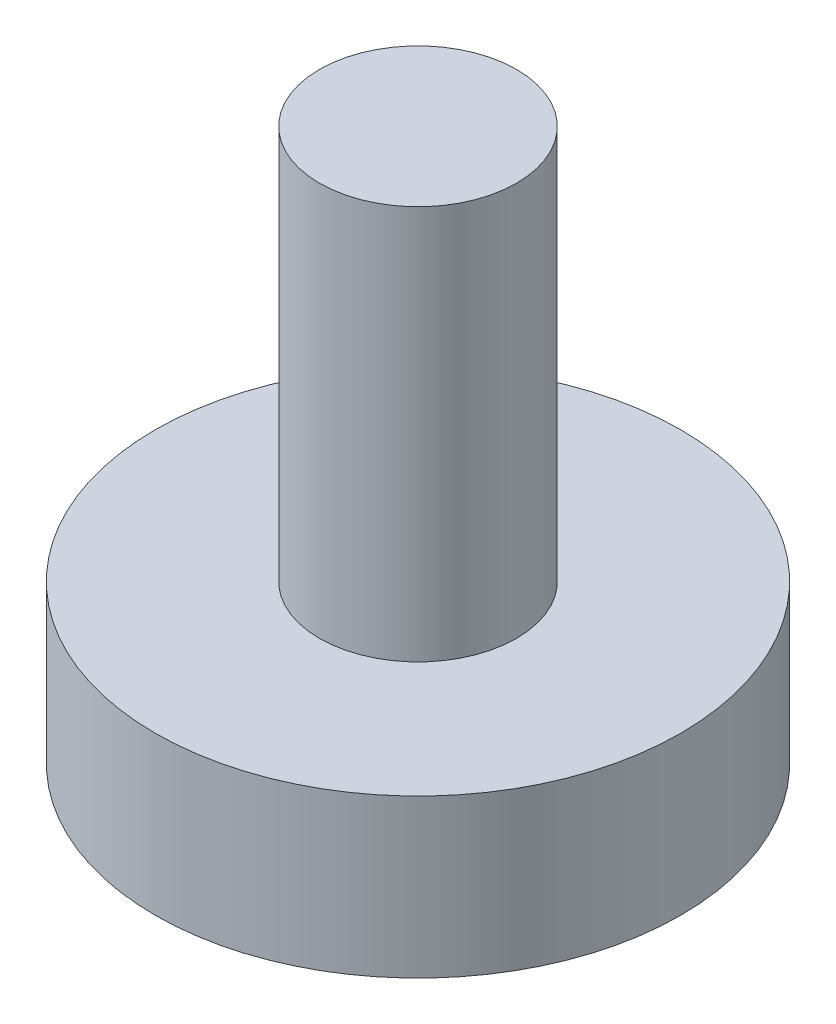
ISO-10303-21;
HEADER;
FILE_DESCRIPTION(('STEP AP214'),'2;1');
FILE_NAME('part.step','',(''),(''),'','','');
FILE_SCHEMA(('AUTOMOTIVE_DESIGN { 1 0 10303 214 1 1 1 1 }'));
ENDSEC;
DATA;
#1=APPLICATION_CONTEXT('core data for automotive mechanical design processes');
#2=APPLICATION_PROTOCOL_DEFINITION('international standard','automotive_design',2000,#1);
#3=PRODUCT_CONTEXT('',#1,'mechanical');
#4=PRODUCT('Part','Part','',(#3));
#5=PRODUCT_RELATED_PRODUCT_CATEGORY('part','',(#4));
#6=PRODUCT_DEFINITION_FORMATION('','',#4);
#7=PRODUCT_DEFINITION_CONTEXT('part definition',#1,'design');
#8=PRODUCT_DEFINITION('design','',#6,#7);
#9=PRODUCT_DEFINITION_SHAPE('','',#8);
#10=(LENGTH_UNIT() NAMED_UNIT(*) SI_UNIT(.MILLI.,.METRE.));
#11=(NAMED_UNIT(*) PLANE_ANGLE_UNIT() SI_UNIT($,.RADIAN.));
#12=(NAMED_UNIT(*) SI_UNIT($,.STERADIAN.) SOLID_ANGLE_UNIT());
#13=UNCERTAINTY_MEASURE_WITH_UNIT(LENGTH_MEASURE(1.E-05),#10,'distance_accuracy_value','');
#14=(GEOMETRIC_REPRESENTATION_CONTEXT(3) GLOBAL_UNCERTAINTY_ASSIGNED_CONTEXT((#13)) GLOBAL_UNIT_ASSIGNED_CONTEXT((#10,
#11,#12)) REPRESENTATION_CONTEXT('',''));
#15=CARTESIAN_POINT('',(0.,0.,0.));
#16=DIRECTION('',(0.,0.,1.));
#17=DIRECTION('',(1.,0.,0.));
#18=AXIS2_PLACEMENT_3D('',#15,#16,#17);
#19=CARTESIAN_POINT('',(0.,6.,0.));
#20=DIRECTION('',(0.,-1.,0.));
#21=DIRECTION('',(0.,0.,-1.));
#22=AXIS2_PLACEMENT_3D('',#19,#20,#21);
#23=CYLINDRICAL_SURFACE('',#22,10.);
#24=CARTESIAN_POINT('',(0.,6.,0.));
#25=DIRECTION('',(0.,1.,0.));
#26=DIRECTION('',(0.,0.,1.));
#27=AXIS2_PLACEMENT_3D('',#24,#25,#26);
#28=CIRCLE('',#27,10.);
#29=CARTESIAN_POINT('',(0.,6.,10.));
#30=VERTEX_POINT('',#29);
#31=EDGE_CURVE('E49',#30,#30,#28,.T.);
#32=ORIENTED_EDGE('',*,*,#31,.F.);
#33=EDGE_LOOP('',(#32));
#34=FACE_BOUND('',#33,.T.);
#35=CARTESIAN_POINT('',(0.,0.,0.));
#36=DIRECTION('',(0.,1.,0.));
#37=DIRECTION('',(0.,0.,1.));
#38=AXIS2_PLACEMENT_3D('',#35,#36,#37);
#39=CIRCLE('',#38,10.);
#40=CARTESIAN_POINT('',(0.,0.,10.));
#41=VERTEX_POINT('',#40);
#42=EDGE_CURVE('E44',#41,#41,#39,.T.);
#43=ORIENTED_EDGE('',*,*,#42,.T.);
#44=EDGE_LOOP('',(#43));
#45=FACE_BOUND('',#44,.T.);
#46=ADVANCED_FACE('F41',(#34,#45),#23,.T.);
#47=CARTESIAN_POINT('',(0.,6.,0.));
#48=DIRECTION('',(0.,1.,0.));
#49=DIRECTION('',(0.,0.,1.));
#50=AXIS2_PLACEMENT_3D('',#47,#48,#49);
#51=PLANE('',#50);
#52=CARTESIAN_POINT('',(0.,6.,0.));
#53=DIRECTION('',(0.,1.,0.));
#54=DIRECTION('',(0.,0.,1.));
#55=AXIS2_PLACEMENT_3D('',#52,#53,#54);
#56=CIRCLE('',#55,3.75);
#57=CARTESIAN_POINT('',(0.,6.,3.75));
#58=VERTEX_POINT('',#57);
#59=EDGE_CURVE('E10',#58,#58,#56,.T.);
#60=ORIENTED_EDGE('',*,*,#59,.F.);
#61=EDGE_LOOP('',(#60));
#62=FACE_BOUND('',#61,.T.);
#63=ORIENTED_EDGE('',*,*,#31,.T.);
#64=EDGE_LOOP('',(#63));
#65=FACE_BOUND('',#64,.T.);
#66=ADVANCED_FACE('F69',(#62,#65),#51,.T.);
#67=CARTESIAN_POINT('',(0.,0.,0.));
#68=DIRECTION('',(0.,1.,0.));
#69=DIRECTION('',(0.,0.,1.));
#70=AXIS2_PLACEMENT_3D('',#67,#68,#69);
#71=PLANE('',#70);
#72=ORIENTED_EDGE('',*,*,#42,.F.);
#73=EDGE_LOOP('',(#72));
#74=FACE_BOUND('',#73,.T.);
#75=ADVANCED_FACE('F66',(#74),#71,.F.);
#76=CARTESIAN_POINT('',(0.,21.,0.));
#77=DIRECTION('',(0.,-1.,0.));
#78=DIRECTION('',(0.,0.,-1.));
#79=AXIS2_PLACEMENT_3D('',#76,#77,#78);
#80=CYLINDRICAL_SURFACE('',#79,3.75);
#81=CARTESIAN_POINT('',(0.,21.,0.));
#82=DIRECTION('',(0.,1.,0.));
#83=DIRECTION('',(0.,0.,1.));
#84=AXIS2_PLACEMENT_3D('',#81,#82,#83);
#85=CIRCLE('',#84,3.75);
#86=CARTESIAN_POINT('',(0.,21.,3.75));
#87=VERTEX_POINT('',#86);
#88=EDGE_CURVE('E56',#87,#87,#85,.T.);
#89=ORIENTED_EDGE('',*,*,#88,.F.);
#90=EDGE_LOOP('',(#89));
#91=FACE_BOUND('',#90,.T.);
#92=ORIENTED_EDGE('',*,*,#59,.T.);
#93=EDGE_LOOP('',(#92));
#94=FACE_BOUND('',#93,.T.);
#95=ADVANCED_FACE('F68',(#91,#94),#80,.T.);
#96=CARTESIAN_POINT('',(0.,21.,0.));
#97=DIRECTION('',(0.,1.,0.));
#98=DIRECTION('',(0.,0.,1.));
#99=AXIS2_PLACEMENT_3D('',#96,#97,#98);
#100=PLANE('',#99);
#101=ORIENTED_EDGE('',*,*,#88,.T.);
#102=EDGE_LOOP('',(#101));
#103=FACE_BOUND('',#102,.T.);
#104=ADVANCED_FACE('F74',(#103),#100,.T.);
#105=CLOSED_SHELL('',(#46,#66,#75,#95,#104));
#106=MANIFOLD_SOLID_BREP('B2',#105);
#107=ADVANCED_BREP_SHAPE_REPRESENTATION('',(#18,#106),#14);
#108=SHAPE_DEFINITION_REPRESENTATION(#9,#107);
ENDSEC;
END-ISO-10303-21;
